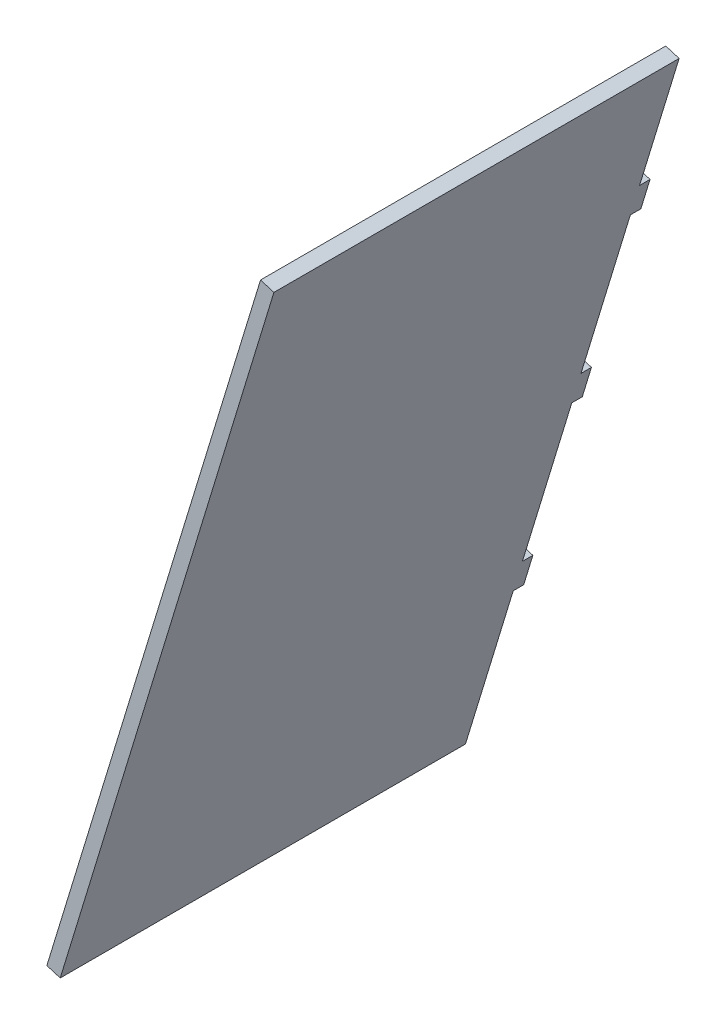
ISO-10303-21;
HEADER;
FILE_DESCRIPTION(('STEP AP214'),'2;1');
FILE_NAME('part.step','',(''),(''),'','','');
FILE_SCHEMA(('AUTOMOTIVE_DESIGN { 1 0 10303 214 1 1 1 1 }'));
ENDSEC;
DATA;
#1=APPLICATION_CONTEXT('core data for automotive mechanical design processes');
#2=APPLICATION_PROTOCOL_DEFINITION('international standard','automotive_design',2000,#1);
#3=PRODUCT_CONTEXT('',#1,'mechanical');
#4=PRODUCT('Part','Part','',(#3));
#5=PRODUCT_RELATED_PRODUCT_CATEGORY('part','',(#4));
#6=PRODUCT_DEFINITION_FORMATION('','',#4);
#7=PRODUCT_DEFINITION_CONTEXT('part definition',#1,'design');
#8=PRODUCT_DEFINITION('design','',#6,#7);
#9=PRODUCT_DEFINITION_SHAPE('','',#8);
#10=(LENGTH_UNIT() NAMED_UNIT(*) SI_UNIT(.MILLI.,.METRE.));
#11=(NAMED_UNIT(*) PLANE_ANGLE_UNIT() SI_UNIT($,.RADIAN.));
#12=(NAMED_UNIT(*) SI_UNIT($,.STERADIAN.) SOLID_ANGLE_UNIT());
#13=UNCERTAINTY_MEASURE_WITH_UNIT(LENGTH_MEASURE(1.E-05),#10,'distance_accuracy_value','');
#14=(GEOMETRIC_REPRESENTATION_CONTEXT(3) GLOBAL_UNCERTAINTY_ASSIGNED_CONTEXT((#13)) GLOBAL_UNIT_ASSIGNED_CONTEXT((#10,
#11,#12)) REPRESENTATION_CONTEXT('',''));
#15=CARTESIAN_POINT('',(0.,0.,0.));
#16=DIRECTION('',(0.,0.,1.));
#17=DIRECTION('',(1.,0.,0.));
#18=AXIS2_PLACEMENT_3D('',#15,#16,#17);
#19=CARTESIAN_POINT('',(203.492974004185,-177.727954084638,0.));
#20=DIRECTION('',(0.,0.,-1.));
#21=DIRECTION('',(0.291732485186372,0.956499951430727,0.));
#22=AXIS2_PLACEMENT_3D('',#19,#20,#21);
#23=PLANE('',#22);
#24=DIRECTION('',(0.956499951430727,-0.291732485186372,0.));
#25=VECTOR('',#24,1.);
#26=CARTESIAN_POINT('',(203.492974004185,-177.727954084638,0.));
#27=LINE('',#26,#25);
#28=CARTESIAN_POINT('',(199.666974198463,-176.561024143893,0.));
#29=VERTEX_POINT('',#28);
#30=CARTESIAN_POINT('',(203.492974004185,-177.727954084638,0.));
#31=VERTEX_POINT('',#30);
#32=EDGE_CURVE('E11',#29,#31,#27,.T.);
#33=ORIENTED_EDGE('',*,*,#32,.F.);
#34=DIRECTION('',(0.291732485186372,0.956499951430727,0.));
#35=VECTOR('',#34,1.);
#36=CARTESIAN_POINT('',(231.941709075593,-70.7422212680558,0.));
#37=LINE('',#36,#35);
#38=CARTESIAN_POINT('',(211.,-139.403562499507,0.));
#39=VERTEX_POINT('',#38);
#40=EDGE_CURVE('E128',#29,#39,#37,.T.);
#41=ORIENTED_EDGE('',*,*,#40,.T.);
#42=DIRECTION('',(0.956499951430727,-0.291732485186372,0.));
#43=VECTOR('',#42,1.);
#44=CARTESIAN_POINT('',(214.825999805723,-140.570492440253,0.));
#45=LINE('',#44,#43);
#46=CARTESIAN_POINT('',(214.825999805723,-140.570492440253,0.));
#47=VERTEX_POINT('',#46);
#48=EDGE_CURVE('E47',#39,#47,#45,.T.);
#49=ORIENTED_EDGE('',*,*,#48,.T.);
#50=DIRECTION('',(0.291732485186372,0.956499951430727,0.));
#51=VECTOR('',#50,1.);
#52=CARTESIAN_POINT('',(203.492974004185,-177.727954084638,0.));
#53=LINE('',#52,#51);
#54=EDGE_CURVE('E215',#31,#47,#53,.T.);
#55=ORIENTED_EDGE('',*,*,#54,.F.);
#56=EDGE_LOOP('',(#33,#41,#49,#55));
#57=FACE_BOUND('',#56,.T.);
#58=ADVANCED_FACE('F37',(#57),#23,.T.);
#59=CARTESIAN_POINT('',(214.825999805723,-140.570492440253,0.));
#60=DIRECTION('',(0.291732485186372,0.956499951430727,0.));
#61=DIRECTION('',(0.,0.,1.));
#62=AXIS2_PLACEMENT_3D('',#59,#60,#61);
#63=PLANE('',#62);
#64=ORIENTED_EDGE('',*,*,#48,.F.);
#65=DIRECTION('',(0.,0.,1.));
#66=VECTOR('',#65,1.);
#67=CARTESIAN_POINT('',(211.,-139.403562499507,0.));
#68=LINE('',#67,#66);
#69=CARTESIAN_POINT('',(211.,-139.403562499507,116.));
#70=VERTEX_POINT('',#69);
#71=EDGE_CURVE('E171',#39,#70,#68,.T.);
#72=ORIENTED_EDGE('',*,*,#71,.T.);
#73=DIRECTION('',(0.956499951430727,-0.291732485186372,0.));
#74=VECTOR('',#73,1.);
#75=CARTESIAN_POINT('',(214.825999805723,-140.570492440253,116.));
#76=LINE('',#75,#74);
#77=CARTESIAN_POINT('',(214.825999805723,-140.570492440253,116.));
#78=VERTEX_POINT('',#77);
#79=EDGE_CURVE('E208',#70,#78,#76,.T.);
#80=ORIENTED_EDGE('',*,*,#79,.T.);
#81=DIRECTION('',(0.,0.,1.));
#82=VECTOR('',#81,1.);
#83=CARTESIAN_POINT('',(214.825999805723,-140.570492440253,0.));
#84=LINE('',#83,#82);
#85=EDGE_CURVE('E224',#47,#78,#84,.T.);
#86=ORIENTED_EDGE('',*,*,#85,.F.);
#87=EDGE_LOOP('',(#64,#72,#80,#86));
#88=FACE_BOUND('',#87,.T.);
#89=ADVANCED_FACE('F227',(#88),#63,.T.);
#90=CARTESIAN_POINT('',(214.825999805723,-140.570492440253,116.));
#91=DIRECTION('',(0.,0.,1.));
#92=DIRECTION('',(-0.291732485186372,-0.956499951430727,0.));
#93=AXIS2_PLACEMENT_3D('',#90,#91,#92);
#94=PLANE('',#93);
#95=ORIENTED_EDGE('',*,*,#79,.F.);
#96=DIRECTION('',(0.291732485186372,0.956499951430727,0.));
#97=VECTOR('',#96,1.);
#98=CARTESIAN_POINT('',(231.941709075593,-70.7422212680558,116.));
#99=LINE('',#98,#97);
#100=CARTESIAN_POINT('',(149.833568822625,-339.949238490901,116.));
#101=VERTEX_POINT('',#100);
#102=EDGE_CURVE('E168',#70,#101,#99,.F.);
#103=ORIENTED_EDGE('',*,*,#102,.T.);
#104=DIRECTION('',(0.956499951430727,-0.291732485186372,0.));
#105=VECTOR('',#104,1.);
#106=CARTESIAN_POINT('',(153.659568628348,-341.116168431646,116.));
#107=LINE('',#106,#105);
#108=CARTESIAN_POINT('',(153.659568628348,-341.116168431646,116.));
#109=VERTEX_POINT('',#108);
#110=EDGE_CURVE('E205',#101,#109,#107,.T.);
#111=ORIENTED_EDGE('',*,*,#110,.T.);
#112=DIRECTION('',(-0.291732485186372,-0.956499951430727,0.));
#113=VECTOR('',#112,1.);
#114=CARTESIAN_POINT('',(214.825999805723,-140.570492440253,116.));
#115=LINE('',#114,#113);
#116=EDGE_CURVE('E228',#78,#109,#115,.T.);
#117=ORIENTED_EDGE('',*,*,#116,.F.);
#118=EDGE_LOOP('',(#95,#103,#111,#117));
#119=FACE_BOUND('',#118,.T.);
#120=ADVANCED_FACE('F303',(#119),#94,.T.);
#121=CARTESIAN_POINT('',(153.659568628348,-341.116168431646,116.));
#122=DIRECTION('',(-0.291732485186372,-0.956499951430727,0.));
#123=DIRECTION('',(0.,0.,-1.));
#124=AXIS2_PLACEMENT_3D('',#121,#122,#123);
#125=PLANE('',#124);
#126=ORIENTED_EDGE('',*,*,#110,.F.);
#127=DIRECTION('',(0.,0.,1.));
#128=VECTOR('',#127,1.);
#129=CARTESIAN_POINT('',(149.833568822625,-339.949238490901,0.));
#130=LINE('',#129,#128);
#131=CARTESIAN_POINT('',(149.833568822625,-339.949238490901,0.));
#132=VERTEX_POINT('',#131);
#133=EDGE_CURVE('E165',#101,#132,#130,.F.);
#134=ORIENTED_EDGE('',*,*,#133,.T.);
#135=DIRECTION('',(0.956499951430727,-0.291732485186372,0.));
#136=VECTOR('',#135,1.);
#137=CARTESIAN_POINT('',(153.659568628348,-341.116168431646,0.));
#138=LINE('',#137,#136);
#139=CARTESIAN_POINT('',(153.659568628348,-341.116168431646,0.));
#140=VERTEX_POINT('',#139);
#141=EDGE_CURVE('E202',#132,#140,#138,.T.);
#142=ORIENTED_EDGE('',*,*,#141,.T.);
#143=DIRECTION('',(0.,0.,-1.));
#144=VECTOR('',#143,1.);
#145=CARTESIAN_POINT('',(153.659568628348,-341.116168431646,116.));
#146=LINE('',#145,#144);
#147=EDGE_CURVE('E230',#109,#140,#146,.T.);
#148=ORIENTED_EDGE('',*,*,#147,.F.);
#149=EDGE_LOOP('',(#126,#134,#142,#148));
#150=FACE_BOUND('',#149,.T.);
#151=ADVANCED_FACE('F309',(#150),#125,.T.);
#152=CARTESIAN_POINT('',(153.659568628348,-341.116168431646,0.));
#153=DIRECTION('',(0.,0.,-1.));
#154=DIRECTION('',(0.291732485186372,0.956499951430727,0.));
#155=AXIS2_PLACEMENT_3D('',#152,#153,#154);
#156=PLANE('',#155);
#157=ORIENTED_EDGE('',*,*,#141,.F.);
#158=DIRECTION('',(0.291732485186372,0.956499951430727,0.));
#159=VECTOR('',#158,1.);
#160=CARTESIAN_POINT('',(231.941709075593,-70.7422212680558,0.));
#161=LINE('',#160,#159);
#162=CARTESIAN_POINT('',(163.503956514878,-295.128295237612,0.));
#163=VERTEX_POINT('',#162);
#164=EDGE_CURVE('E162',#132,#163,#161,.T.);
#165=ORIENTED_EDGE('',*,*,#164,.T.);
#166=DIRECTION('',(0.956499951430727,-0.291732485186372,0.));
#167=VECTOR('',#166,1.);
#168=CARTESIAN_POINT('',(167.329956320601,-296.295225178358,0.));
#169=LINE('',#168,#167);
#170=CARTESIAN_POINT('',(167.329956320601,-296.295225178358,0.));
#171=VERTEX_POINT('',#170);
#172=EDGE_CURVE('E199',#163,#171,#169,.T.);
#173=ORIENTED_EDGE('',*,*,#172,.T.);
#174=DIRECTION('',(0.291732485186372,0.956499951430727,0.));
#175=VECTOR('',#174,1.);
#176=CARTESIAN_POINT('',(153.659568628348,-341.116168431646,0.));
#177=LINE('',#176,#175);
#178=EDGE_CURVE('E236',#140,#171,#177,.T.);
#179=ORIENTED_EDGE('',*,*,#178,.F.);
#180=EDGE_LOOP('',(#157,#165,#173,#179));
#181=FACE_BOUND('',#180,.T.);
#182=ADVANCED_FACE('F312',(#181),#156,.T.);
#183=CARTESIAN_POINT('',(167.329956320601,-296.295225178358,0.));
#184=DIRECTION('',(-0.291732485186372,-0.956499951430727,0.));
#185=DIRECTION('',(0.,0.,-1.));
#186=AXIS2_PLACEMENT_3D('',#183,#184,#185);
#187=PLANE('',#186);
#188=ORIENTED_EDGE('',*,*,#172,.F.);
#189=DIRECTION('',(0.,0.,1.));
#190=VECTOR('',#189,1.);
#191=CARTESIAN_POINT('',(163.503956514878,-295.128295237612,0.));
#192=LINE('',#191,#190);
#193=CARTESIAN_POINT('',(163.503956514878,-295.128295237612,-3.));
#194=VERTEX_POINT('',#193);
#195=EDGE_CURVE('E159',#163,#194,#192,.F.);
#196=ORIENTED_EDGE('',*,*,#195,.T.);
#197=DIRECTION('',(0.956499951430727,-0.291732485186372,0.));
#198=VECTOR('',#197,1.);
#199=CARTESIAN_POINT('',(167.329956320601,-296.295225178358,-3.));
#200=LINE('',#199,#198);
#201=CARTESIAN_POINT('',(167.329956320601,-296.295225178358,-3.));
#202=VERTEX_POINT('',#201);
#203=EDGE_CURVE('E196',#194,#202,#200,.T.);
#204=ORIENTED_EDGE('',*,*,#203,.T.);
#205=DIRECTION('',(0.,0.,-1.));
#206=VECTOR('',#205,1.);
#207=CARTESIAN_POINT('',(167.329956320601,-296.295225178358,0.));
#208=LINE('',#207,#206);
#209=EDGE_CURVE('E239',#171,#202,#208,.T.);
#210=ORIENTED_EDGE('',*,*,#209,.F.);
#211=EDGE_LOOP('',(#188,#196,#204,#210));
#212=FACE_BOUND('',#211,.T.);
#213=ADVANCED_FACE('F317',(#212),#187,.T.);
#214=CARTESIAN_POINT('',(167.329956320601,-296.295225178358,-3.));
#215=DIRECTION('',(0.,0.,-1.));
#216=DIRECTION('',(0.291732485186372,0.956499951430727,0.));
#217=AXIS2_PLACEMENT_3D('',#214,#215,#216);
#218=PLANE('',#217);
#219=ORIENTED_EDGE('',*,*,#203,.F.);
#220=DIRECTION('',(0.291732485186372,0.956499951430727,0.));
#221=VECTOR('',#220,1.);
#222=CARTESIAN_POINT('',(231.941709075593,-70.7422212680558,-3.));
#223=LINE('',#222,#221);
#224=CARTESIAN_POINT('',(166.129548881556,-286.519795674736,-3.));
#225=VERTEX_POINT('',#224);
#226=EDGE_CURVE('E156',#194,#225,#223,.T.);
#227=ORIENTED_EDGE('',*,*,#226,.T.);
#228=DIRECTION('',(0.956499951430727,-0.291732485186372,0.));
#229=VECTOR('',#228,1.);
#230=CARTESIAN_POINT('',(169.955548687278,-287.686725615481,-3.));
#231=LINE('',#230,#229);
#232=CARTESIAN_POINT('',(169.955548687278,-287.686725615481,-3.));
#233=VERTEX_POINT('',#232);
#234=EDGE_CURVE('E193',#225,#233,#231,.T.);
#235=ORIENTED_EDGE('',*,*,#234,.T.);
#236=DIRECTION('',(0.291732485186372,0.956499951430727,0.));
#237=VECTOR('',#236,1.);
#238=CARTESIAN_POINT('',(167.329956320601,-296.295225178358,-3.));
#239=LINE('',#238,#237);
#240=EDGE_CURVE('E242',#202,#233,#239,.T.);
#241=ORIENTED_EDGE('',*,*,#240,.F.);
#242=EDGE_LOOP('',(#219,#227,#235,#241));
#243=FACE_BOUND('',#242,.T.);
#244=ADVANCED_FACE('F322',(#243),#218,.T.);
#245=CARTESIAN_POINT('',(169.955548687278,-287.686725615481,-3.));
#246=DIRECTION('',(0.291732485186372,0.956499951430727,0.));
#247=DIRECTION('',(0.,0.,1.));
#248=AXIS2_PLACEMENT_3D('',#245,#246,#247);
#249=PLANE('',#248);
#250=ORIENTED_EDGE('',*,*,#234,.F.);
#251=DIRECTION('',(0.,0.,1.));
#252=VECTOR('',#251,1.);
#253=CARTESIAN_POINT('',(166.129548881556,-286.519795674736,0.));
#254=LINE('',#253,#252);
#255=CARTESIAN_POINT('',(166.129548881556,-286.519795674736,0.));
#256=VERTEX_POINT('',#255);
#257=EDGE_CURVE('E153',#225,#256,#254,.T.);
#258=ORIENTED_EDGE('',*,*,#257,.T.);
#259=DIRECTION('',(0.956499951430727,-0.291732485186372,0.));
#260=VECTOR('',#259,1.);
#261=CARTESIAN_POINT('',(169.955548687278,-287.686725615481,0.));
#262=LINE('',#261,#260);
#263=CARTESIAN_POINT('',(169.955548687278,-287.686725615481,0.));
#264=VERTEX_POINT('',#263);
#265=EDGE_CURVE('E190',#256,#264,#262,.T.);
#266=ORIENTED_EDGE('',*,*,#265,.T.);
#267=DIRECTION('',(0.,0.,1.));
#268=VECTOR('',#267,1.);
#269=CARTESIAN_POINT('',(169.955548687278,-287.686725615481,-3.));
#270=LINE('',#269,#268);
#271=EDGE_CURVE('E245',#233,#264,#270,.T.);
#272=ORIENTED_EDGE('',*,*,#271,.F.);
#273=EDGE_LOOP('',(#250,#258,#266,#272));
#274=FACE_BOUND('',#273,.T.);
#275=ADVANCED_FACE('F324',(#274),#249,.T.);
#276=CARTESIAN_POINT('',(169.955548687278,-287.686725615481,0.));
#277=DIRECTION('',(0.,0.,-1.));
#278=DIRECTION('',(0.291732485186372,0.956499951430727,0.));
#279=AXIS2_PLACEMENT_3D('',#276,#277,#278);
#280=PLANE('',#279);
#281=ORIENTED_EDGE('',*,*,#265,.F.);
#282=DIRECTION('',(0.291732485186372,0.956499951430727,0.));
#283=VECTOR('',#282,1.);
#284=CARTESIAN_POINT('',(231.941709075593,-70.7422212680558,0.));
#285=LINE('',#284,#283);
#286=CARTESIAN_POINT('',(180.272669173332,-240.148909472191,0.));
#287=VERTEX_POINT('',#286);
#288=EDGE_CURVE('E150',#256,#287,#285,.T.);
#289=ORIENTED_EDGE('',*,*,#288,.T.);
#290=DIRECTION('',(0.956499951430727,-0.291732485186372,0.));
#291=VECTOR('',#290,1.);
#292=CARTESIAN_POINT('',(184.098668979055,-241.315839412936,0.));
#293=LINE('',#292,#291);
#294=CARTESIAN_POINT('',(184.098668979055,-241.315839412936,0.));
#295=VERTEX_POINT('',#294);
#296=EDGE_CURVE('E187',#287,#295,#293,.T.);
#297=ORIENTED_EDGE('',*,*,#296,.T.);
#298=DIRECTION('',(0.291732485186372,0.956499951430727,0.));
#299=VECTOR('',#298,1.);
#300=CARTESIAN_POINT('',(169.955548687278,-287.686725615481,0.));
#301=LINE('',#300,#299);
#302=EDGE_CURVE('E248',#264,#295,#301,.T.);
#303=ORIENTED_EDGE('',*,*,#302,.F.);
#304=EDGE_LOOP('',(#281,#289,#297,#303));
#305=FACE_BOUND('',#304,.T.);
#306=ADVANCED_FACE('F326',(#305),#280,.T.);
#307=CARTESIAN_POINT('',(184.098668979055,-241.315839412936,0.));
#308=DIRECTION('',(-0.291732485186372,-0.956499951430727,0.));
#309=DIRECTION('',(0.,0.,-1.));
#310=AXIS2_PLACEMENT_3D('',#307,#308,#309);
#311=PLANE('',#310);
#312=ORIENTED_EDGE('',*,*,#296,.F.);
#313=DIRECTION('',(0.,0.,1.));
#314=VECTOR('',#313,1.);
#315=CARTESIAN_POINT('',(180.272669173332,-240.148909472191,0.));
#316=LINE('',#315,#314);
#317=CARTESIAN_POINT('',(180.272669173332,-240.148909472191,-3.));
#318=VERTEX_POINT('',#317);
#319=EDGE_CURVE('E147',#287,#318,#316,.F.);
#320=ORIENTED_EDGE('',*,*,#319,.T.);
#321=DIRECTION('',(0.956499951430727,-0.291732485186372,0.));
#322=VECTOR('',#321,1.);
#323=CARTESIAN_POINT('',(184.098668979055,-241.315839412936,-3.));
#324=LINE('',#323,#322);
#325=CARTESIAN_POINT('',(184.098668979055,-241.315839412936,-3.));
#326=VERTEX_POINT('',#325);
#327=EDGE_CURVE('E184',#318,#326,#324,.T.);
#328=ORIENTED_EDGE('',*,*,#327,.T.);
#329=DIRECTION('',(0.,0.,-1.));
#330=VECTOR('',#329,1.);
#331=CARTESIAN_POINT('',(184.098668979055,-241.315839412936,0.));
#332=LINE('',#331,#330);
#333=EDGE_CURVE('E251',#295,#326,#332,.T.);
#334=ORIENTED_EDGE('',*,*,#333,.F.);
#335=EDGE_LOOP('',(#312,#320,#328,#334));
#336=FACE_BOUND('',#335,.T.);
#337=ADVANCED_FACE('F283',(#336),#311,.T.);
#338=CARTESIAN_POINT('',(184.098668979055,-241.315839412936,-3.));
#339=DIRECTION('',(0.,0.,-1.));
#340=DIRECTION('',(0.29173248518637,0.956499951430728,0.));
#341=AXIS2_PLACEMENT_3D('',#338,#339,#340);
#342=PLANE('',#341);
#343=ORIENTED_EDGE('',*,*,#327,.F.);
#344=DIRECTION('',(0.291732485186372,0.956499951430727,0.));
#345=VECTOR('',#344,1.);
#346=CARTESIAN_POINT('',(231.941709075593,-70.7422212680558,-3.));
#347=LINE('',#346,#345);
#348=CARTESIAN_POINT('',(182.898261540009,-231.540409909314,-3.));
#349=VERTEX_POINT('',#348);
#350=EDGE_CURVE('E144',#318,#349,#347,.T.);
#351=ORIENTED_EDGE('',*,*,#350,.T.);
#352=DIRECTION('',(0.956499951430727,-0.291732485186372,0.));
#353=VECTOR('',#352,1.);
#354=CARTESIAN_POINT('',(186.724261345732,-232.70733985006,-3.));
#355=LINE('',#354,#353);
#356=CARTESIAN_POINT('',(186.724261345732,-232.70733985006,-3.));
#357=VERTEX_POINT('',#356);
#358=EDGE_CURVE('E181',#349,#357,#355,.T.);
#359=ORIENTED_EDGE('',*,*,#358,.T.);
#360=DIRECTION('',(0.29173248518637,0.956499951430728,0.));
#361=VECTOR('',#360,1.);
#362=CARTESIAN_POINT('',(184.098668979055,-241.315839412936,-3.));
#363=LINE('',#362,#361);
#364=EDGE_CURVE('E254',#326,#357,#363,.T.);
#365=ORIENTED_EDGE('',*,*,#364,.F.);
#366=EDGE_LOOP('',(#343,#351,#359,#365));
#367=FACE_BOUND('',#366,.T.);
#368=ADVANCED_FACE('F275',(#367),#342,.T.);
#369=CARTESIAN_POINT('',(186.724261345732,-232.70733985006,-3.));
#370=DIRECTION('',(0.291732485186372,0.956499951430727,0.));
#371=DIRECTION('',(0.,0.,1.));
#372=AXIS2_PLACEMENT_3D('',#369,#370,#371);
#373=PLANE('',#372);
#374=ORIENTED_EDGE('',*,*,#358,.F.);
#375=DIRECTION('',(0.,0.,1.));
#376=VECTOR('',#375,1.);
#377=CARTESIAN_POINT('',(182.898261540009,-231.540409909314,0.));
#378=LINE('',#377,#376);
#379=CARTESIAN_POINT('',(182.898261540009,-231.540409909314,0.));
#380=VERTEX_POINT('',#379);
#381=EDGE_CURVE('E141',#349,#380,#378,.T.);
#382=ORIENTED_EDGE('',*,*,#381,.T.);
#383=DIRECTION('',(0.956499951430727,-0.291732485186372,0.));
#384=VECTOR('',#383,1.);
#385=CARTESIAN_POINT('',(186.724261345732,-232.70733985006,0.));
#386=LINE('',#385,#384);
#387=CARTESIAN_POINT('',(186.724261345732,-232.70733985006,0.));
#388=VERTEX_POINT('',#387);
#389=EDGE_CURVE('E178',#380,#388,#386,.T.);
#390=ORIENTED_EDGE('',*,*,#389,.T.);
#391=DIRECTION('',(0.,0.,1.));
#392=VECTOR('',#391,1.);
#393=CARTESIAN_POINT('',(186.724261345732,-232.70733985006,-3.));
#394=LINE('',#393,#392);
#395=EDGE_CURVE('E257',#357,#388,#394,.T.);
#396=ORIENTED_EDGE('',*,*,#395,.F.);
#397=EDGE_LOOP('',(#374,#382,#390,#396));
#398=FACE_BOUND('',#397,.T.);
#399=ADVANCED_FACE('F270',(#398),#373,.T.);
#400=CARTESIAN_POINT('',(186.724261345732,-232.70733985006,0.));
#401=DIRECTION('',(0.,0.,-1.));
#402=DIRECTION('',(0.291732485186372,0.956499951430727,0.));
#403=AXIS2_PLACEMENT_3D('',#400,#401,#402);
#404=PLANE('',#403);
#405=ORIENTED_EDGE('',*,*,#389,.F.);
#406=DIRECTION('',(0.291732485186372,0.956499951430727,0.));
#407=VECTOR('',#406,1.);
#408=CARTESIAN_POINT('',(231.941709075593,-70.7422212680558,0.));
#409=LINE('',#408,#407);
#410=CARTESIAN_POINT('',(197.041381831785,-185.169523706769,0.));
#411=VERTEX_POINT('',#410);
#412=EDGE_CURVE('E138',#380,#411,#409,.T.);
#413=ORIENTED_EDGE('',*,*,#412,.T.);
#414=DIRECTION('',(0.956499951430727,-0.291732485186372,0.));
#415=VECTOR('',#414,1.);
#416=CARTESIAN_POINT('',(200.867381637508,-186.336453647515,0.));
#417=LINE('',#416,#415);
#418=CARTESIAN_POINT('',(200.867381637508,-186.336453647515,0.));
#419=VERTEX_POINT('',#418);
#420=EDGE_CURVE('E176',#411,#419,#417,.T.);
#421=ORIENTED_EDGE('',*,*,#420,.T.);
#422=DIRECTION('',(0.291732485186372,0.956499951430727,0.));
#423=VECTOR('',#422,1.);
#424=CARTESIAN_POINT('',(186.724261345732,-232.70733985006,0.));
#425=LINE('',#424,#423);
#426=EDGE_CURVE('E259',#388,#419,#425,.T.);
#427=ORIENTED_EDGE('',*,*,#426,.F.);
#428=EDGE_LOOP('',(#405,#413,#421,#427));
#429=FACE_BOUND('',#428,.T.);
#430=ADVANCED_FACE('F266',(#429),#404,.T.);
#431=CARTESIAN_POINT('',(200.867381637508,-186.336453647515,0.));
#432=DIRECTION('',(-0.291732485186372,-0.956499951430727,0.));
#433=DIRECTION('',(0.,0.,-1.));
#434=AXIS2_PLACEMENT_3D('',#431,#432,#433);
#435=PLANE('',#434);
#436=ORIENTED_EDGE('',*,*,#420,.F.);
#437=DIRECTION('',(0.,0.,1.));
#438=VECTOR('',#437,1.);
#439=CARTESIAN_POINT('',(197.041381831785,-185.169523706769,0.));
#440=LINE('',#439,#438);
#441=CARTESIAN_POINT('',(197.041381831785,-185.169523706769,-3.));
#442=VERTEX_POINT('',#441);
#443=EDGE_CURVE('E135',#411,#442,#440,.F.);
#444=ORIENTED_EDGE('',*,*,#443,.T.);
#445=DIRECTION('',(0.956499951430727,-0.291732485186372,0.));
#446=VECTOR('',#445,1.);
#447=CARTESIAN_POINT('',(200.867381637508,-186.336453647515,-3.));
#448=LINE('',#447,#446);
#449=CARTESIAN_POINT('',(200.867381637508,-186.336453647515,-3.));
#450=VERTEX_POINT('',#449);
#451=EDGE_CURVE('E55',#442,#450,#448,.T.);
#452=ORIENTED_EDGE('',*,*,#451,.T.);
#453=DIRECTION('',(0.,0.,-1.));
#454=VECTOR('',#453,1.);
#455=CARTESIAN_POINT('',(200.867381637508,-186.336453647515,0.));
#456=LINE('',#455,#454);
#457=EDGE_CURVE('E121',#419,#450,#456,.T.);
#458=ORIENTED_EDGE('',*,*,#457,.F.);
#459=EDGE_LOOP('',(#436,#444,#452,#458));
#460=FACE_BOUND('',#459,.T.);
#461=ADVANCED_FACE('F263',(#460),#435,.T.);
#462=CARTESIAN_POINT('',(200.867381637508,-186.336453647515,-3.));
#463=DIRECTION('',(0.,0.,-1.));
#464=DIRECTION('',(0.291732485186372,0.956499951430727,0.));
#465=AXIS2_PLACEMENT_3D('',#462,#463,#464);
#466=PLANE('',#465);
#467=ORIENTED_EDGE('',*,*,#451,.F.);
#468=DIRECTION('',(0.291732485186372,0.956499951430727,0.));
#469=VECTOR('',#468,1.);
#470=CARTESIAN_POINT('',(231.941709075593,-70.7422212680558,-3.));
#471=LINE('',#470,#469);
#472=CARTESIAN_POINT('',(199.666974198463,-176.561024143893,-3.));
#473=VERTEX_POINT('',#472);
#474=EDGE_CURVE('E126',#442,#473,#471,.T.);
#475=ORIENTED_EDGE('',*,*,#474,.T.);
#476=DIRECTION('',(0.956499951430727,-0.291732485186372,0.));
#477=VECTOR('',#476,1.);
#478=CARTESIAN_POINT('',(203.492974004185,-177.727954084638,-3.));
#479=LINE('',#478,#477);
#480=CARTESIAN_POINT('',(203.492974004185,-177.727954084638,-3.));
#481=VERTEX_POINT('',#480);
#482=EDGE_CURVE('E41',#473,#481,#479,.T.);
#483=ORIENTED_EDGE('',*,*,#482,.T.);
#484=DIRECTION('',(0.291732485186372,0.956499951430727,0.));
#485=VECTOR('',#484,1.);
#486=CARTESIAN_POINT('',(200.867381637508,-186.336453647515,-3.));
#487=LINE('',#486,#485);
#488=EDGE_CURVE('E137',#450,#481,#487,.T.);
#489=ORIENTED_EDGE('',*,*,#488,.F.);
#490=EDGE_LOOP('',(#467,#475,#483,#489));
#491=FACE_BOUND('',#490,.T.);
#492=ADVANCED_FACE('F130',(#491),#466,.T.);
#493=CARTESIAN_POINT('',(203.492974004185,-177.727954084638,-3.));
#494=DIRECTION('',(0.291732485186372,0.956499951430727,0.));
#495=DIRECTION('',(0.,0.,1.));
#496=AXIS2_PLACEMENT_3D('',#493,#494,#495);
#497=PLANE('',#496);
#498=DIRECTION('',(0.,0.,1.));
#499=VECTOR('',#498,1.);
#500=CARTESIAN_POINT('',(199.666974198463,-176.561024143893,0.));
#501=LINE('',#500,#499);
#502=EDGE_CURVE('E115',#473,#29,#501,.T.);
#503=ORIENTED_EDGE('',*,*,#502,.T.);
#504=ORIENTED_EDGE('',*,*,#32,.T.);
#505=DIRECTION('',(0.,0.,1.));
#506=VECTOR('',#505,1.);
#507=CARTESIAN_POINT('',(203.492974004185,-177.727954084638,-3.));
#508=LINE('',#507,#506);
#509=EDGE_CURVE('E117',#481,#31,#508,.T.);
#510=ORIENTED_EDGE('',*,*,#509,.F.);
#511=ORIENTED_EDGE('',*,*,#482,.F.);
#512=EDGE_LOOP('',(#503,#504,#510,#511));
#513=FACE_BOUND('',#512,.T.);
#514=ADVANCED_FACE('F39',(#513),#497,.T.);
#515=CARTESIAN_POINT('',(235.767708881316,-71.9091512088013,0.));
#516=DIRECTION('',(0.956499951430727,-0.291732485186372,0.));
#517=DIRECTION('',(0.291732485186372,0.956499951430727,0.));
#518=AXIS2_PLACEMENT_3D('',#515,#516,#517);
#519=PLANE('',#518);
#520=ORIENTED_EDGE('',*,*,#488,.T.);
#521=ORIENTED_EDGE('',*,*,#509,.T.);
#522=ORIENTED_EDGE('',*,*,#54,.T.);
#523=ORIENTED_EDGE('',*,*,#85,.T.);
#524=ORIENTED_EDGE('',*,*,#116,.T.);
#525=ORIENTED_EDGE('',*,*,#147,.T.);
#526=ORIENTED_EDGE('',*,*,#178,.T.);
#527=ORIENTED_EDGE('',*,*,#209,.T.);
#528=ORIENTED_EDGE('',*,*,#240,.T.);
#529=ORIENTED_EDGE('',*,*,#271,.T.);
#530=ORIENTED_EDGE('',*,*,#302,.T.);
#531=ORIENTED_EDGE('',*,*,#333,.T.);
#532=ORIENTED_EDGE('',*,*,#364,.T.);
#533=ORIENTED_EDGE('',*,*,#395,.T.);
#534=ORIENTED_EDGE('',*,*,#426,.T.);
#535=ORIENTED_EDGE('',*,*,#457,.T.);
#536=EDGE_LOOP('',(#520,#521,#522,#523,#524,#525,#526,#527,#528,#529,#530,#531,#532,#533,#534,#535));
#537=FACE_BOUND('',#536,.T.);
#538=ADVANCED_FACE('F222',(#537),#519,.T.);
#539=CARTESIAN_POINT('',(231.941709075593,-70.7422212680558,0.));
#540=DIRECTION('',(0.956499951430727,-0.291732485186372,0.));
#541=DIRECTION('',(0.291732485186372,0.956499951430727,0.));
#542=AXIS2_PLACEMENT_3D('',#539,#540,#541);
#543=PLANE('',#542);
#544=ORIENTED_EDGE('',*,*,#474,.F.);
#545=ORIENTED_EDGE('',*,*,#443,.F.);
#546=ORIENTED_EDGE('',*,*,#412,.F.);
#547=ORIENTED_EDGE('',*,*,#381,.F.);
#548=ORIENTED_EDGE('',*,*,#350,.F.);
#549=ORIENTED_EDGE('',*,*,#319,.F.);
#550=ORIENTED_EDGE('',*,*,#288,.F.);
#551=ORIENTED_EDGE('',*,*,#257,.F.);
#552=ORIENTED_EDGE('',*,*,#226,.F.);
#553=ORIENTED_EDGE('',*,*,#195,.F.);
#554=ORIENTED_EDGE('',*,*,#164,.F.);
#555=ORIENTED_EDGE('',*,*,#133,.F.);
#556=ORIENTED_EDGE('',*,*,#102,.F.);
#557=ORIENTED_EDGE('',*,*,#71,.F.);
#558=ORIENTED_EDGE('',*,*,#40,.F.);
#559=ORIENTED_EDGE('',*,*,#502,.F.);
#560=EDGE_LOOP('',(#544,#545,#546,#547,#548,#549,#550,#551,#552,#553,#554,#555,#556,#557,#558,#559));
#561=FACE_BOUND('',#560,.T.);
#562=ADVANCED_FACE('F124',(#561),#543,.F.);
#563=CLOSED_SHELL('',(#58,#89,#120,#151,#182,#213,#244,#275,#306,#337,#368,#399,#430,#461,#492,
#514,#538,#562));
#564=MANIFOLD_SOLID_BREP('B2',#563);
#565=ADVANCED_BREP_SHAPE_REPRESENTATION('',(#18,#564),#14);
#566=SHAPE_DEFINITION_REPRESENTATION(#9,#565);
ENDSEC;
END-ISO-10303-21;
